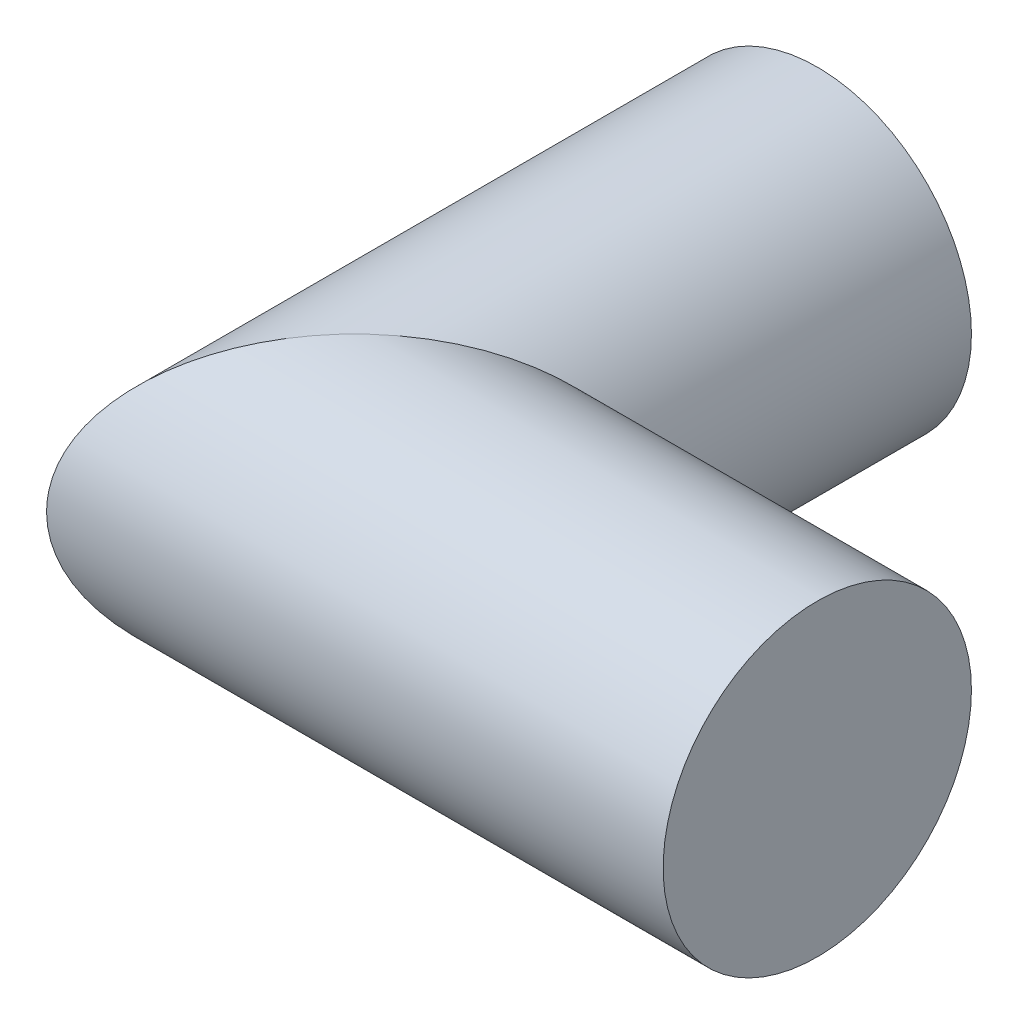
ISO-10303-21;
HEADER;
FILE_DESCRIPTION(('STEP AP214'),'2;1');
FILE_NAME('part.step','',(''),(''),'','','');
FILE_SCHEMA(('AUTOMOTIVE_DESIGN { 1 0 10303 214 1 1 1 1 }'));
ENDSEC;
DATA;
#1=APPLICATION_CONTEXT('core data for automotive mechanical design processes');
#2=APPLICATION_PROTOCOL_DEFINITION('international standard','automotive_design',2000,#1);
#3=PRODUCT_CONTEXT('',#1,'mechanical');
#4=PRODUCT('Part','Part','',(#3));
#5=PRODUCT_RELATED_PRODUCT_CATEGORY('part','',(#4));
#6=PRODUCT_DEFINITION_FORMATION('','',#4);
#7=PRODUCT_DEFINITION_CONTEXT('part definition',#1,'design');
#8=PRODUCT_DEFINITION('design','',#6,#7);
#9=PRODUCT_DEFINITION_SHAPE('','',#8);
#10=(LENGTH_UNIT() NAMED_UNIT(*) SI_UNIT(.MILLI.,.METRE.));
#11=(NAMED_UNIT(*) PLANE_ANGLE_UNIT() SI_UNIT($,.RADIAN.));
#12=(NAMED_UNIT(*) SI_UNIT($,.STERADIAN.) SOLID_ANGLE_UNIT());
#13=UNCERTAINTY_MEASURE_WITH_UNIT(LENGTH_MEASURE(1.E-05),#10,'distance_accuracy_value','');
#14=(GEOMETRIC_REPRESENTATION_CONTEXT(3) GLOBAL_UNCERTAINTY_ASSIGNED_CONTEXT((#13)) GLOBAL_UNIT_ASSIGNED_CONTEXT((#10,
#11,#12)) REPRESENTATION_CONTEXT('',''));
#15=CARTESIAN_POINT('',(0.,0.,0.));
#16=DIRECTION('',(0.,0.,1.));
#17=DIRECTION('',(1.,0.,0.));
#18=AXIS2_PLACEMENT_3D('',#15,#16,#17);
#19=CARTESIAN_POINT('',(-15.,0.,-15.));
#20=DIRECTION('',(0.,0.,-1.));
#21=DIRECTION('',(1.,0.,0.));
#22=AXIS2_PLACEMENT_3D('',#19,#20,#21);
#23=PLANE('',#22);
#24=CARTESIAN_POINT('',(-15.,0.,-15.));
#25=DIRECTION('',(0.,0.,1.));
#26=DIRECTION('',(1.,0.,0.));
#27=AXIS2_PLACEMENT_3D('',#24,#25,#26);
#28=CIRCLE('',#27,5.);
#29=CARTESIAN_POINT('',(-10.,0.,-15.));
#30=VERTEX_POINT('',#29);
#31=EDGE_CURVE('E36',#30,#30,#28,.T.);
#32=ORIENTED_EDGE('',*,*,#31,.F.);
#33=EDGE_LOOP('',(#32));
#34=FACE_BOUND('',#33,.T.);
#35=ADVANCED_FACE('F33',(#34),#23,.T.);
#36=CARTESIAN_POINT('',(0.,0.,0.));
#37=DIRECTION('',(-1.,0.,0.));
#38=DIRECTION('',(0.,0.,-1.));
#39=AXIS2_PLACEMENT_3D('',#36,#37,#38);
#40=PLANE('',#39);
#41=CARTESIAN_POINT('',(0.,0.,0.));
#42=DIRECTION('',(1.,0.,0.));
#43=DIRECTION('',(0.,0.,-1.));
#44=AXIS2_PLACEMENT_3D('',#41,#42,#43);
#45=CIRCLE('',#44,5.);
#46=CARTESIAN_POINT('',(0.,0.,-5.));
#47=VERTEX_POINT('',#46);
#48=EDGE_CURVE('E40',#47,#47,#45,.T.);
#49=ORIENTED_EDGE('',*,*,#48,.T.);
#50=EDGE_LOOP('',(#49));
#51=FACE_BOUND('',#50,.T.);
#52=ADVANCED_FACE('F53',(#51),#40,.F.);
#53=CARTESIAN_POINT('',(-15.,0.,5.6));
#54=DIRECTION('',(0.,0.,-1.));
#55=DIRECTION('',(1.,0.,0.));
#56=AXIS2_PLACEMENT_3D('',#53,#54,#55);
#57=CYLINDRICAL_SURFACE('',#56,5.);
#58=CARTESIAN_POINT('',(-15.,0.,0.));
#59=DIRECTION('',(0.707106781186547,0.,0.707106781186547));
#60=DIRECTION('',(-0.707106781186548,0.,0.707106781186548));
#61=AXIS2_PLACEMENT_3D('',#58,#59,#60);
#62=ELLIPSE('',#61,7.07106781186548,5.);
#63=CARTESIAN_POINT('',(-20.,0.,5.));
#64=VERTEX_POINT('',#63);
#65=EDGE_CURVE('E10',#64,#64,#62,.F.);
#66=ORIENTED_EDGE('',*,*,#65,.T.);
#67=EDGE_LOOP('',(#66));
#68=FACE_BOUND('',#67,.T.);
#69=ORIENTED_EDGE('',*,*,#31,.T.);
#70=EDGE_LOOP('',(#69));
#71=FACE_BOUND('',#70,.T.);
#72=ADVANCED_FACE('F50',(#68,#71),#57,.T.);
#73=CARTESIAN_POINT('',(0.,0.,0.));
#74=DIRECTION('',(-1.,0.,0.));
#75=DIRECTION('',(0.,0.,-1.));
#76=AXIS2_PLACEMENT_3D('',#73,#74,#75);
#77=CYLINDRICAL_SURFACE('',#76,5.);
#78=ORIENTED_EDGE('',*,*,#48,.F.);
#79=EDGE_LOOP('',(#78));
#80=FACE_BOUND('',#79,.T.);
#81=ORIENTED_EDGE('',*,*,#65,.F.);
#82=EDGE_LOOP('',(#81));
#83=FACE_BOUND('',#82,.T.);
#84=ADVANCED_FACE('F60',(#80,#83),#77,.T.);
#85=CLOSED_SHELL('',(#35,#52,#72,#84));
#86=MANIFOLD_SOLID_BREP('B2',#85);
#87=ADVANCED_BREP_SHAPE_REPRESENTATION('',(#18,#86),#14);
#88=SHAPE_DEFINITION_REPRESENTATION(#9,#87);
ENDSEC;
END-ISO-10303-21;
